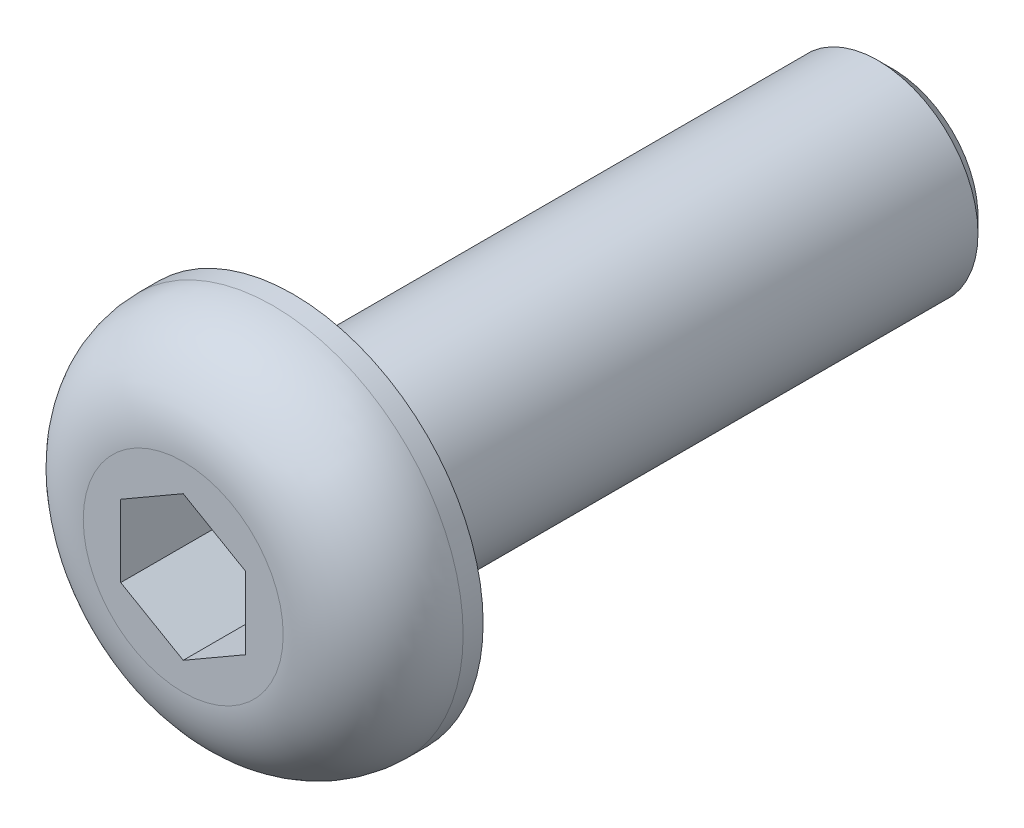
ISO-10303-21;
HEADER;
FILE_DESCRIPTION(('STEP AP214'),'2;1');
FILE_NAME('part.step','',(''),(''),'','','');
FILE_SCHEMA(('AUTOMOTIVE_DESIGN { 1 0 10303 214 1 1 1 1 }'));
ENDSEC;
DATA;
#1=APPLICATION_CONTEXT('core data for automotive mechanical design processes');
#2=APPLICATION_PROTOCOL_DEFINITION('international standard','automotive_design',2000,#1);
#3=PRODUCT_CONTEXT('',#1,'mechanical');
#4=PRODUCT('Part','Part','',(#3));
#5=PRODUCT_RELATED_PRODUCT_CATEGORY('part','',(#4));
#6=PRODUCT_DEFINITION_FORMATION('','',#4);
#7=PRODUCT_DEFINITION_CONTEXT('part definition',#1,'design');
#8=PRODUCT_DEFINITION('design','',#6,#7);
#9=PRODUCT_DEFINITION_SHAPE('','',#8);
#10=(LENGTH_UNIT() NAMED_UNIT(*) SI_UNIT(.MILLI.,.METRE.));
#11=(NAMED_UNIT(*) PLANE_ANGLE_UNIT() SI_UNIT($,.RADIAN.));
#12=(NAMED_UNIT(*) SI_UNIT($,.STERADIAN.) SOLID_ANGLE_UNIT());
#13=UNCERTAINTY_MEASURE_WITH_UNIT(LENGTH_MEASURE(1.E-05),#10,'distance_accuracy_value','');
#14=(GEOMETRIC_REPRESENTATION_CONTEXT(3) GLOBAL_UNCERTAINTY_ASSIGNED_CONTEXT((#13)) GLOBAL_UNIT_ASSIGNED_CONTEXT((#10,
#11,#12)) REPRESENTATION_CONTEXT('',''));
#15=CARTESIAN_POINT('',(0.,0.,0.));
#16=DIRECTION('',(0.,0.,1.));
#17=DIRECTION('',(1.,0.,0.));
#18=AXIS2_PLACEMENT_3D('',#15,#16,#17);
#19=CARTESIAN_POINT('',(0.,0.,0.));
#20=DIRECTION('',(0.,0.,1.));
#21=DIRECTION('',(1.,0.,0.));
#22=AXIS2_PLACEMENT_3D('',#19,#20,#21);
#23=PLANE('',#22);
#24=CARTESIAN_POINT('',(0.,0.,0.));
#25=DIRECTION('',(0.,0.,1.));
#26=DIRECTION('',(1.,0.,0.));
#27=AXIS2_PLACEMENT_3D('',#24,#25,#26);
#28=CIRCLE('',#27,3.8);
#29=CARTESIAN_POINT('',(3.8,0.,0.));
#30=VERTEX_POINT('',#29);
#31=EDGE_CURVE('E135',#30,#30,#28,.T.);
#32=ORIENTED_EDGE('',*,*,#31,.F.);
#33=EDGE_LOOP('',(#32));
#34=FACE_BOUND('',#33,.T.);
#35=CARTESIAN_POINT('',(0.,0.,0.));
#36=DIRECTION('',(0.,0.,1.));
#37=DIRECTION('',(1.,0.,0.));
#38=AXIS2_PLACEMENT_3D('',#35,#36,#37);
#39=CIRCLE('',#38,2.);
#40=CARTESIAN_POINT('',(2.,0.,0.));
#41=VERTEX_POINT('',#40);
#42=EDGE_CURVE('E143',#41,#41,#39,.F.);
#43=ORIENTED_EDGE('',*,*,#42,.F.);
#44=EDGE_LOOP('',(#43));
#45=FACE_BOUND('',#44,.T.);
#46=ADVANCED_FACE('F33',(#34,#45),#23,.F.);
#47=CARTESIAN_POINT('',(0.,0.,2.2));
#48=DIRECTION('',(0.,0.,-1.));
#49=DIRECTION('',(-1.,0.,0.));
#50=AXIS2_PLACEMENT_3D('',#47,#48,#49);
#51=CYLINDRICAL_SURFACE('',#50,3.8);
#52=CARTESIAN_POINT('',(0.,0.,0.4));
#53=DIRECTION('',(0.,0.,1.));
#54=DIRECTION('',(1.,0.,0.));
#55=AXIS2_PLACEMENT_3D('',#52,#53,#54);
#56=CIRCLE('',#55,3.8);
#57=CARTESIAN_POINT('',(3.8,0.,0.4));
#58=VERTEX_POINT('',#57);
#59=EDGE_CURVE('E11',#58,#58,#56,.F.);
#60=ORIENTED_EDGE('',*,*,#59,.T.);
#61=EDGE_LOOP('',(#60));
#62=FACE_BOUND('',#61,.T.);
#63=ORIENTED_EDGE('',*,*,#31,.T.);
#64=EDGE_LOOP('',(#63));
#65=FACE_BOUND('',#64,.T.);
#66=ADVANCED_FACE('F166',(#62,#65),#51,.T.);
#67=CARTESIAN_POINT('',(0.,0.,2.2));
#68=DIRECTION('',(0.,0.,1.));
#69=DIRECTION('',(1.,0.,0.));
#70=AXIS2_PLACEMENT_3D('',#67,#68,#69);
#71=PLANE('',#70);
#72=CARTESIAN_POINT('',(0.,0.,2.2));
#73=DIRECTION('',(0.,0.,1.));
#74=DIRECTION('',(1.,0.,0.));
#75=AXIS2_PLACEMENT_3D('',#72,#73,#74);
#76=CIRCLE('',#75,2.);
#77=CARTESIAN_POINT('',(2.,0.,2.2));
#78=VERTEX_POINT('',#77);
#79=EDGE_CURVE('E41',#78,#78,#76,.T.);
#80=ORIENTED_EDGE('',*,*,#79,.T.);
#81=EDGE_LOOP('',(#80));
#82=FACE_BOUND('',#81,.T.);
#83=DIRECTION('',(-0.866025403784439,0.5,0.));
#84=VECTOR('',#83,1.);
#85=CARTESIAN_POINT('',(1.25,0.721687836487033,2.2));
#86=LINE('',#85,#84);
#87=CARTESIAN_POINT('',(1.25,0.721687836487033,2.2));
#88=VERTEX_POINT('',#87);
#89=CARTESIAN_POINT('',(0.,1.44337567297406,2.2));
#90=VERTEX_POINT('',#89);
#91=EDGE_CURVE('E48',#88,#90,#86,.T.);
#92=ORIENTED_EDGE('',*,*,#91,.F.);
#93=DIRECTION('',(0.,1.,0.));
#94=VECTOR('',#93,1.);
#95=CARTESIAN_POINT('',(1.25,-0.721687836487033,2.2));
#96=LINE('',#95,#94);
#97=CARTESIAN_POINT('',(1.25,-0.721687836487033,2.2));
#98=VERTEX_POINT('',#97);
#99=EDGE_CURVE('E131',#98,#88,#96,.T.);
#100=ORIENTED_EDGE('',*,*,#99,.F.);
#101=DIRECTION('',(0.866025403784439,0.5,0.));
#102=VECTOR('',#101,1.);
#103=CARTESIAN_POINT('',(0.,-1.44337567297406,2.2));
#104=LINE('',#103,#102);
#105=CARTESIAN_POINT('',(0.,-1.44337567297406,2.2));
#106=VERTEX_POINT('',#105);
#107=EDGE_CURVE('E129',#106,#98,#104,.T.);
#108=ORIENTED_EDGE('',*,*,#107,.F.);
#109=DIRECTION('',(0.866025403784439,-0.5,0.));
#110=VECTOR('',#109,1.);
#111=CARTESIAN_POINT('',(-1.25,-0.721687836487032,2.2));
#112=LINE('',#111,#110);
#113=CARTESIAN_POINT('',(-1.25,-0.721687836487032,2.2));
#114=VERTEX_POINT('',#113);
#115=EDGE_CURVE('E96',#114,#106,#112,.T.);
#116=ORIENTED_EDGE('',*,*,#115,.F.);
#117=DIRECTION('',(0.,-1.,0.));
#118=VECTOR('',#117,1.);
#119=CARTESIAN_POINT('',(-1.25,0.721687836487033,2.2));
#120=LINE('',#119,#118);
#121=CARTESIAN_POINT('',(-1.25,0.721687836487033,2.2));
#122=VERTEX_POINT('',#121);
#123=EDGE_CURVE('E125',#122,#114,#120,.T.);
#124=ORIENTED_EDGE('',*,*,#123,.F.);
#125=DIRECTION('',(-0.866025403784439,-0.5,0.));
#126=VECTOR('',#125,1.);
#127=CARTESIAN_POINT('',(0.,1.44337567297406,2.2));
#128=LINE('',#127,#126);
#129=EDGE_CURVE('E122',#90,#122,#128,.T.);
#130=ORIENTED_EDGE('',*,*,#129,.F.);
#131=EDGE_LOOP('',(#92,#100,#108,#116,#124,#130));
#132=FACE_BOUND('',#131,.T.);
#133=ADVANCED_FACE('F154',(#82,#132),#71,.T.);
#134=CARTESIAN_POINT('',(0.,0.,-12.));
#135=DIRECTION('',(0.,0.,1.));
#136=DIRECTION('',(1.,0.,0.));
#137=AXIS2_PLACEMENT_3D('',#134,#135,#136);
#138=CYLINDRICAL_SURFACE('',#137,2.);
#139=CARTESIAN_POINT('',(0.,0.,-11.7));
#140=DIRECTION('',(0.,0.,-1.));
#141=DIRECTION('',(-1.,0.,0.));
#142=AXIS2_PLACEMENT_3D('',#139,#140,#141);
#143=CIRCLE('',#142,2.);
#144=CARTESIAN_POINT('',(-2.,0.,-11.7));
#145=VERTEX_POINT('',#144);
#146=EDGE_CURVE('E149',#145,#145,#143,.F.);
#147=ORIENTED_EDGE('',*,*,#146,.T.);
#148=EDGE_LOOP('',(#147));
#149=FACE_BOUND('',#148,.T.);
#150=ORIENTED_EDGE('',*,*,#42,.T.);
#151=EDGE_LOOP('',(#150));
#152=FACE_BOUND('',#151,.T.);
#153=ADVANCED_FACE('F189',(#149,#152),#138,.T.);
#154=CARTESIAN_POINT('',(0.,0.,-12.));
#155=DIRECTION('',(0.,0.,-1.));
#156=DIRECTION('',(-1.,0.,0.));
#157=AXIS2_PLACEMENT_3D('',#154,#155,#156);
#158=PLANE('',#157);
#159=CARTESIAN_POINT('',(0.,0.,-12.));
#160=DIRECTION('',(0.,0.,-1.));
#161=DIRECTION('',(-1.,0.,0.));
#162=AXIS2_PLACEMENT_3D('',#159,#160,#161);
#163=CIRCLE('',#162,1.7);
#164=CARTESIAN_POINT('',(-1.7,0.,-12.));
#165=VERTEX_POINT('',#164);
#166=EDGE_CURVE('E146',#165,#165,#163,.T.);
#167=ORIENTED_EDGE('',*,*,#166,.T.);
#168=EDGE_LOOP('',(#167));
#169=FACE_BOUND('',#168,.T.);
#170=ADVANCED_FACE('F181',(#169),#158,.T.);
#171=CARTESIAN_POINT('',(0.,0.,-12.));
#172=DIRECTION('',(0.,0.,1.));
#173=DIRECTION('',(1.,0.,0.));
#174=AXIS2_PLACEMENT_3D('',#171,#172,#173);
#175=CONICAL_SURFACE('',#174,1.7,0.785398163397448);
#176=ORIENTED_EDGE('',*,*,#146,.F.);
#177=EDGE_LOOP('',(#176));
#178=FACE_BOUND('',#177,.T.);
#179=ORIENTED_EDGE('',*,*,#166,.F.);
#180=EDGE_LOOP('',(#179));
#181=FACE_BOUND('',#180,.T.);
#182=ADVANCED_FACE('F178',(#178,#181),#175,.T.);
#183=CARTESIAN_POINT('',(1.25,0.721687836487033,0.2));
#184=DIRECTION('',(0.5,0.866025403784439,0.));
#185=DIRECTION('',(-0.866025403784439,0.5,0.));
#186=AXIS2_PLACEMENT_3D('',#183,#184,#185);
#187=PLANE('',#186);
#188=ORIENTED_EDGE('',*,*,#91,.T.);
#189=DIRECTION('',(0.,0.,1.));
#190=VECTOR('',#189,1.);
#191=CARTESIAN_POINT('',(0.,1.44337567297406,0.2));
#192=LINE('',#191,#190);
#193=CARTESIAN_POINT('',(0.,1.44337567297406,0.2));
#194=VERTEX_POINT('',#193);
#195=EDGE_CURVE('E78',#194,#90,#192,.T.);
#196=ORIENTED_EDGE('',*,*,#195,.F.);
#197=DIRECTION('',(-0.866025403784439,0.5,0.));
#198=VECTOR('',#197,1.);
#199=CARTESIAN_POINT('',(1.25,0.721687836487033,0.2));
#200=LINE('',#199,#198);
#201=CARTESIAN_POINT('',(1.25,0.721687836487033,0.2));
#202=VERTEX_POINT('',#201);
#203=EDGE_CURVE('E133',#202,#194,#200,.T.);
#204=ORIENTED_EDGE('',*,*,#203,.F.);
#205=DIRECTION('',(0.,0.,1.));
#206=VECTOR('',#205,1.);
#207=CARTESIAN_POINT('',(1.25,0.721687836487033,0.2));
#208=LINE('',#207,#206);
#209=EDGE_CURVE('E56',#202,#88,#208,.T.);
#210=ORIENTED_EDGE('',*,*,#209,.T.);
#211=EDGE_LOOP('',(#188,#196,#204,#210));
#212=FACE_BOUND('',#211,.T.);
#213=ADVANCED_FACE('F180',(#212),#187,.F.);
#214=CARTESIAN_POINT('',(1.25,-0.721687836487033,0.2));
#215=DIRECTION('',(1.,0.,0.));
#216=DIRECTION('',(0.,1.,0.));
#217=AXIS2_PLACEMENT_3D('',#214,#215,#216);
#218=PLANE('',#217);
#219=ORIENTED_EDGE('',*,*,#99,.T.);
#220=ORIENTED_EDGE('',*,*,#209,.F.);
#221=DIRECTION('',(0.,1.,0.));
#222=VECTOR('',#221,1.);
#223=CARTESIAN_POINT('',(1.25,-0.721687836487033,0.2));
#224=LINE('',#223,#222);
#225=CARTESIAN_POINT('',(1.25,-0.721687836487033,0.2));
#226=VERTEX_POINT('',#225);
#227=EDGE_CURVE('E108',#226,#202,#224,.T.);
#228=ORIENTED_EDGE('',*,*,#227,.F.);
#229=DIRECTION('',(0.,0.,1.));
#230=VECTOR('',#229,1.);
#231=CARTESIAN_POINT('',(1.25,-0.721687836487033,0.2));
#232=LINE('',#231,#230);
#233=EDGE_CURVE('E100',#226,#98,#232,.T.);
#234=ORIENTED_EDGE('',*,*,#233,.T.);
#235=EDGE_LOOP('',(#219,#220,#228,#234));
#236=FACE_BOUND('',#235,.T.);
#237=ADVANCED_FACE('F187',(#236),#218,.F.);
#238=CARTESIAN_POINT('',(0.,-1.44337567297406,0.2));
#239=DIRECTION('',(0.5,-0.866025403784439,0.));
#240=DIRECTION('',(0.866025403784439,0.5,0.));
#241=AXIS2_PLACEMENT_3D('',#238,#239,#240);
#242=PLANE('',#241);
#243=ORIENTED_EDGE('',*,*,#107,.T.);
#244=ORIENTED_EDGE('',*,*,#233,.F.);
#245=DIRECTION('',(0.866025403784439,0.5,0.));
#246=VECTOR('',#245,1.);
#247=CARTESIAN_POINT('',(0.,-1.44337567297406,0.2));
#248=LINE('',#247,#246);
#249=CARTESIAN_POINT('',(0.,-1.44337567297406,0.2));
#250=VERTEX_POINT('',#249);
#251=EDGE_CURVE('E104',#250,#226,#248,.T.);
#252=ORIENTED_EDGE('',*,*,#251,.F.);
#253=DIRECTION('',(0.,0.,1.));
#254=VECTOR('',#253,1.);
#255=CARTESIAN_POINT('',(0.,-1.44337567297406,0.2));
#256=LINE('',#255,#254);
#257=EDGE_CURVE('E89',#250,#106,#256,.T.);
#258=ORIENTED_EDGE('',*,*,#257,.T.);
#259=EDGE_LOOP('',(#243,#244,#252,#258));
#260=FACE_BOUND('',#259,.T.);
#261=ADVANCED_FACE('F105',(#260),#242,.F.);
#262=CARTESIAN_POINT('',(-1.25,-0.721687836487032,0.2));
#263=DIRECTION('',(-0.5,-0.866025403784439,0.));
#264=DIRECTION('',(0.866025403784439,-0.5,0.));
#265=AXIS2_PLACEMENT_3D('',#262,#263,#264);
#266=PLANE('',#265);
#267=ORIENTED_EDGE('',*,*,#115,.T.);
#268=ORIENTED_EDGE('',*,*,#257,.F.);
#269=DIRECTION('',(0.866025403784439,-0.5,0.));
#270=VECTOR('',#269,1.);
#271=CARTESIAN_POINT('',(-1.25,-0.721687836487032,0.2));
#272=LINE('',#271,#270);
#273=CARTESIAN_POINT('',(-1.25,-0.721687836487032,0.2));
#274=VERTEX_POINT('',#273);
#275=EDGE_CURVE('E93',#274,#250,#272,.T.);
#276=ORIENTED_EDGE('',*,*,#275,.F.);
#277=DIRECTION('',(0.,0.,1.));
#278=VECTOR('',#277,1.);
#279=CARTESIAN_POINT('',(-1.25,-0.721687836487032,0.2));
#280=LINE('',#279,#278);
#281=EDGE_CURVE('E101',#274,#114,#280,.T.);
#282=ORIENTED_EDGE('',*,*,#281,.T.);
#283=EDGE_LOOP('',(#267,#268,#276,#282));
#284=FACE_BOUND('',#283,.T.);
#285=ADVANCED_FACE('F91',(#284),#266,.F.);
#286=CARTESIAN_POINT('',(-1.25,0.721687836487033,0.2));
#287=DIRECTION('',(-1.,0.,0.));
#288=DIRECTION('',(0.,0.,1.));
#289=AXIS2_PLACEMENT_3D('',#286,#287,#288);
#290=PLANE('',#289);
#291=ORIENTED_EDGE('',*,*,#123,.T.);
#292=ORIENTED_EDGE('',*,*,#281,.F.);
#293=DIRECTION('',(0.,-1.,0.));
#294=VECTOR('',#293,1.);
#295=CARTESIAN_POINT('',(-1.25,0.721687836487033,0.2));
#296=LINE('',#295,#294);
#297=CARTESIAN_POINT('',(-1.25,0.721687836487033,0.2));
#298=VERTEX_POINT('',#297);
#299=EDGE_CURVE('E114',#298,#274,#296,.T.);
#300=ORIENTED_EDGE('',*,*,#299,.F.);
#301=DIRECTION('',(0.,0.,1.));
#302=VECTOR('',#301,1.);
#303=CARTESIAN_POINT('',(-1.25,0.721687836487033,0.2));
#304=LINE('',#303,#302);
#305=EDGE_CURVE('E138',#298,#122,#304,.T.);
#306=ORIENTED_EDGE('',*,*,#305,.T.);
#307=EDGE_LOOP('',(#291,#292,#300,#306));
#308=FACE_BOUND('',#307,.T.);
#309=ADVANCED_FACE('F205',(#308),#290,.F.);
#310=CARTESIAN_POINT('',(0.,1.44337567297406,0.2));
#311=DIRECTION('',(-0.5,0.866025403784439,0.));
#312=DIRECTION('',(-0.866025403784439,-0.5,0.));
#313=AXIS2_PLACEMENT_3D('',#310,#311,#312);
#314=PLANE('',#313);
#315=ORIENTED_EDGE('',*,*,#129,.T.);
#316=ORIENTED_EDGE('',*,*,#305,.F.);
#317=DIRECTION('',(-0.866025403784439,-0.5,0.));
#318=VECTOR('',#317,1.);
#319=CARTESIAN_POINT('',(0.,1.44337567297406,0.2));
#320=LINE('',#319,#318);
#321=EDGE_CURVE('E116',#194,#298,#320,.T.);
#322=ORIENTED_EDGE('',*,*,#321,.F.);
#323=ORIENTED_EDGE('',*,*,#195,.T.);
#324=EDGE_LOOP('',(#315,#316,#322,#323));
#325=FACE_BOUND('',#324,.T.);
#326=ADVANCED_FACE('F162',(#325),#314,.F.);
#327=CARTESIAN_POINT('',(0.,0.,0.2));
#328=DIRECTION('',(0.,0.,1.));
#329=DIRECTION('',(1.,0.,0.));
#330=AXIS2_PLACEMENT_3D('',#327,#328,#329);
#331=PLANE('',#330);
#332=ORIENTED_EDGE('',*,*,#203,.T.);
#333=ORIENTED_EDGE('',*,*,#321,.T.);
#334=ORIENTED_EDGE('',*,*,#299,.T.);
#335=ORIENTED_EDGE('',*,*,#275,.T.);
#336=ORIENTED_EDGE('',*,*,#251,.T.);
#337=ORIENTED_EDGE('',*,*,#227,.T.);
#338=EDGE_LOOP('',(#332,#333,#334,#335,#336,#337));
#339=FACE_BOUND('',#338,.T.);
#340=ADVANCED_FACE('F111',(#339),#331,.T.);
#341=CARTESIAN_POINT('',(0.,0.,0.4));
#342=DIRECTION('',(0.,0.,1.));
#343=DIRECTION('',(1.,0.,0.));
#344=AXIS2_PLACEMENT_3D('',#341,#342,#343);
#345=TOROIDAL_SURFACE('',#344,2.,1.8);
#346=ORIENTED_EDGE('',*,*,#59,.F.);
#347=EDGE_LOOP('',(#346));
#348=FACE_BOUND('',#347,.T.);
#349=ORIENTED_EDGE('',*,*,#79,.F.);
#350=EDGE_LOOP('',(#349));
#351=FACE_BOUND('',#350,.T.);
#352=ADVANCED_FACE('F35',(#348,#351),#345,.T.);
#353=CLOSED_SHELL('',(#46,#66,#133,#153,#170,#182,#213,#237,#261,#285,#309,#326,#340,#352));
#354=MANIFOLD_SOLID_BREP('B2',#353);
#355=ADVANCED_BREP_SHAPE_REPRESENTATION('',(#18,#354),#14);
#356=SHAPE_DEFINITION_REPRESENTATION(#9,#355);
ENDSEC;
END-ISO-10303-21;
